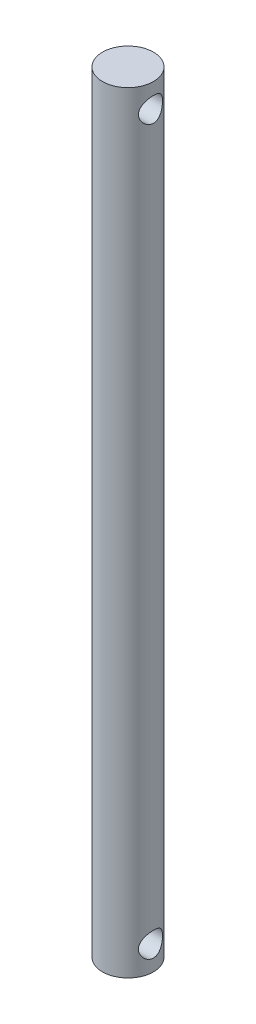
ISO-10303-21;
HEADER;
FILE_DESCRIPTION(('STEP AP214'),'2;1');
FILE_NAME('part.step','',(''),(''),'','','');
FILE_SCHEMA(('AUTOMOTIVE_DESIGN { 1 0 10303 214 1 1 1 1 }'));
ENDSEC;
DATA;
#1=APPLICATION_CONTEXT('core data for automotive mechanical design processes');
#2=APPLICATION_PROTOCOL_DEFINITION('international standard','automotive_design',2000,#1);
#3=PRODUCT_CONTEXT('',#1,'mechanical');
#4=PRODUCT('Part','Part','',(#3));
#5=PRODUCT_RELATED_PRODUCT_CATEGORY('part','',(#4));
#6=PRODUCT_DEFINITION_FORMATION('','',#4);
#7=PRODUCT_DEFINITION_CONTEXT('part definition',#1,'design');
#8=PRODUCT_DEFINITION('design','',#6,#7);
#9=PRODUCT_DEFINITION_SHAPE('','',#8);
#10=(LENGTH_UNIT() NAMED_UNIT(*) SI_UNIT(.MILLI.,.METRE.));
#11=(NAMED_UNIT(*) PLANE_ANGLE_UNIT() SI_UNIT($,.RADIAN.));
#12=(NAMED_UNIT(*) SI_UNIT($,.STERADIAN.) SOLID_ANGLE_UNIT());
#13=UNCERTAINTY_MEASURE_WITH_UNIT(LENGTH_MEASURE(1.E-05),#10,'distance_accuracy_value','');
#14=(GEOMETRIC_REPRESENTATION_CONTEXT(3) GLOBAL_UNCERTAINTY_ASSIGNED_CONTEXT((#13)) GLOBAL_UNIT_ASSIGNED_CONTEXT((#10,
#11,#12)) REPRESENTATION_CONTEXT('',''));
#15=CARTESIAN_POINT('',(0.,0.,0.));
#16=DIRECTION('',(0.,0.,1.));
#17=DIRECTION('',(1.,0.,0.));
#18=AXIS2_PLACEMENT_3D('',#15,#16,#17);
#19=CARTESIAN_POINT('',(0.,48.,0.));
#20=DIRECTION('',(0.,-1.,0.));
#21=DIRECTION('',(0.,0.,-1.));
#22=AXIS2_PLACEMENT_3D('',#19,#20,#21);
#23=CYLINDRICAL_SURFACE('',#22,3.175);
#24=CARTESIAN_POINT('',(-3.175,43.5,0.));
#25=CARTESIAN_POINT('',(-3.17499621985295,43.5000044738965,-0.0793696056331879));
#26=CARTESIAN_POINT('',(-3.17199120370814,43.5063366465158,-0.158848966213319));
#27=CARTESIAN_POINT('',(-3.16026762742416,43.5314003871425,-0.3154907966577));
#28=CARTESIAN_POINT('',(-3.15153670753249,43.5501587788742,-0.392647876041672));
#29=CARTESIAN_POINT('',(-3.12928185140191,43.5991953661397,-0.54213461401645));
#30=CARTESIAN_POINT('',(-3.11577583396693,43.629430525312,-0.614481134826975));
#31=CARTESIAN_POINT('',(-3.08523557557938,43.7003555316825,-0.752982757479882));
#32=CARTESIAN_POINT('',(-3.06820187122341,43.7410437890858,-0.819138798737006));
#33=CARTESIAN_POINT('',(-3.03109215002452,43.8343133724531,-0.947531977551394));
#34=CARTESIAN_POINT('',(-3.01089949607389,43.8874310823474,-1.00934531536299));
#35=CARTESIAN_POINT('',(-2.97016877751052,44.0029059845819,-1.12356872804672));
#36=CARTESIAN_POINT('',(-2.94963048974006,44.0652693664885,-1.17597245123061));
#37=CARTESIAN_POINT('',(-2.90895734211161,44.2025156354503,-1.27340721108708));
#38=CARTESIAN_POINT('',(-2.88894252906622,44.2779584568552,-1.31770529611402));
#39=CARTESIAN_POINT('',(-2.85350194913633,44.4362854939492,-1.39279860497067));
#40=CARTESIAN_POINT('',(-2.83807319122875,44.5191648134291,-1.4236026358555));
#41=CARTESIAN_POINT('',(-2.81484981523147,44.6851826700235,-1.46896762087975));
#42=CARTESIAN_POINT('',(-2.80667245171199,44.7680408954135,-1.48434942407678));
#43=CARTESIAN_POINT('',(-2.79782290647243,44.9355333003305,-1.50096994970779));
#44=CARTESIAN_POINT('',(-2.79714463118969,45.0201659819401,-1.5022201551264));
#45=CARTESIAN_POINT('',(-2.80305593263809,45.1793753085977,-1.49114871052963));
#46=CARTESIAN_POINT('',(-2.80889771224103,45.2540831594443,-1.48022366031689));
#47=CARTESIAN_POINT('',(-2.82589657910714,45.4004446808648,-1.44750469243097));
#48=CARTESIAN_POINT('',(-2.83705508237193,45.4720975322594,-1.42570787921159));
#49=CARTESIAN_POINT('',(-2.86368711079333,45.6123214572522,-1.37144042107045));
#50=CARTESIAN_POINT('',(-2.87925460442575,45.6807826932706,-1.33873421633753));
#51=CARTESIAN_POINT('',(-2.91294481240157,45.8115557706918,-1.26375034917988));
#52=CARTESIAN_POINT('',(-2.93106865023239,45.8738648877214,-1.22146847336964));
#53=CARTESIAN_POINT('',(-2.97027967308475,45.9978860178986,-1.12301829304094));
#54=CARTESIAN_POINT('',(-2.99147184174414,46.0587553417355,-1.06582685913966));
#55=CARTESIAN_POINT('',(-3.03276969244738,46.1703669210121,-0.941911654521736));
#56=CARTESIAN_POINT('',(-3.05287495516681,46.2211052880128,-0.875184240523146));
#57=CARTESIAN_POINT('',(-3.09065813188422,46.3127655304946,-0.730900451942524));
#58=CARTESIAN_POINT('',(-3.10821737934191,46.3532501250906,-0.653032764749386));
#59=CARTESIAN_POINT('',(-3.13795896561378,46.4202348527413,-0.49054980640996));
#60=CARTESIAN_POINT('',(-3.15014513198242,46.4467449432795,-0.405939389394615));
#61=CARTESIAN_POINT('',(-3.16698849385516,46.4830467216995,-0.239325331183664));
#62=CARTESIAN_POINT('',(-3.17215069636453,46.4939630222513,-0.15761808537237));
#63=CARTESIAN_POINT('',(-3.17605374308904,46.5022345017253,0.00662006237334106));
#64=CARTESIAN_POINT('',(-3.17479716715133,46.499595128966,0.0891506200914325));
#65=CARTESIAN_POINT('',(-3.16631250425399,46.4815410497741,0.246790904756254));
#66=CARTESIAN_POINT('',(-3.15949303898597,46.4670003178788,0.322025617263288));
#67=CARTESIAN_POINT('',(-3.14106249856194,46.4268725337062,0.468859911387633));
#68=CARTESIAN_POINT('',(-3.12945086824544,46.4012842015756,0.540459070755479));
#69=CARTESIAN_POINT('',(-3.10206629000487,46.3390272240195,0.680482664613306));
#70=CARTESIAN_POINT('',(-3.08617757605381,46.3020454041442,0.748744433690324));
#71=CARTESIAN_POINT('',(-3.0518284264566,46.2183945744512,0.878333413113472));
#72=CARTESIAN_POINT('',(-3.0333668635778,46.1717213141435,0.939657562453442));
#73=CARTESIAN_POINT('',(-2.99374847615918,46.0651598356938,1.05944471500475));
#74=CARTESIAN_POINT('',(-2.97249840501299,46.0044619699174,1.11715821701519));
#75=CARTESIAN_POINT('',(-2.9310107026401,45.8740799566267,1.22187582163969));
#76=CARTESIAN_POINT('',(-2.91077359415055,45.8043912344258,1.26887443843489));
#77=CARTESIAN_POINT('',(-2.8729842223829,45.6548413943002,1.3523177360002));
#78=CARTESIAN_POINT('',(-2.85555063245794,45.5747097231494,1.3883357483136));
#79=CARTESIAN_POINT('',(-2.82679504093384,45.4084242639191,1.44599796651068));
#80=CARTESIAN_POINT('',(-2.81546607860886,45.3222774617187,1.46765854978947));
#81=CARTESIAN_POINT('',(-2.80148148307169,45.154863402907,1.49416555358527));
#82=CARTESIAN_POINT('',(-2.79812792823293,45.0738695282687,1.50036748851185));
#83=CARTESIAN_POINT('',(-2.79854075870541,44.9119743281721,1.4995991124721));
#84=CARTESIAN_POINT('',(-2.80230499174775,44.8310729821365,1.4926327833113));
#85=CARTESIAN_POINT('',(-2.81582109373829,44.6781381418332,1.46695547456854));
#86=CARTESIAN_POINT('',(-2.82509293077013,44.605899684291,1.44918362899975));
#87=CARTESIAN_POINT('',(-2.84807658169596,44.4654710458926,1.40347262111118));
#88=CARTESIAN_POINT('',(-2.86178973121637,44.3972820901435,1.37553039996267));
#89=CARTESIAN_POINT('',(-2.89323433363553,44.2618894481708,1.30816165903836));
#90=CARTESIAN_POINT('',(-2.9111726221189,44.1950540304397,1.2680940753401));
#91=CARTESIAN_POINT('',(-2.94862781691945,44.0686392018157,1.1783806973407));
#92=CARTESIAN_POINT('',(-2.96814547541437,44.0090632825204,1.12873032344155));
#93=CARTESIAN_POINT('',(-3.00898948839188,43.8924439215314,1.01518945377103));
#94=CARTESIAN_POINT('',(-3.03029315236505,43.8363061865829,0.950355540908536));
#95=CARTESIAN_POINT('',(-3.07039060771353,43.7355582457251,0.811506446201235));
#96=CARTESIAN_POINT('',(-3.08918318329392,43.6909536141019,0.737486850130159));
#97=CARTESIAN_POINT('',(-3.12214803509559,43.6149536802251,0.582310323359671));
#98=CARTESIAN_POINT('',(-3.13633626105316,43.5835126661608,0.501179295246578));
#99=CARTESIAN_POINT('',(-3.15849550789229,43.5350975759745,0.334041202489535));
#100=CARTESIAN_POINT('',(-3.16648489362115,43.5180807524037,0.248049357078901));
#101=CARTESIAN_POINT('',(-3.17226666174443,43.5057935666016,0.134449327489636));
#102=CARTESIAN_POINT('',(-3.17328951708221,43.5036234480032,0.10761975081623));
#103=CARTESIAN_POINT('',(-3.17465683516496,43.5007258896191,0.0538643319459688));
#104=CARTESIAN_POINT('',(-3.17500128300303,43.4999984815345,0.0269384876468133));
#105=CARTESIAN_POINT('',(-3.175,43.5,0.));
#106=B_SPLINE_CURVE_WITH_KNOTS('',3,(#24,#25,#26,#27,#28,#29,#30,#31,#32,#33,#34,#35,#36,#37,
#38,#39,#40,#41,#42,#43,#44,#45,#46,#47,#48,#49,#50,#51,#52,#53,#54,#55,#56,#57,#58,#59,#60,#61,
#62,#63,#64,#65,#66,#67,#68,#69,#70,#71,#72,#73,#74,#75,#76,#77,#78,#79,#80,#81,#82,#83,#84,#85,
#86,#87,#88,#89,#90,#91,#92,#93,#94,#95,#96,#97,#98,#99,#100,#101,#102,#103,#104,#105),
.UNSPECIFIED.,.T.,.F.,(4,2,2,2,2,2,2,2,2,2,2,2,2,2,2,2,2,2,2,2,2,2,2,2,2,2,2,2,2,2,2,2,2,2,2,2,
2,2,2,2,4),(0.,0.237998863435127,0.476513162034362,0.714141760487184,0.951734239756927,
1.202566267352,1.4535669805023,1.72144991719773,1.98915775546695,2.24170968929963,
2.4940563909499,2.72018464462582,2.94637315667184,3.17780125644152,3.40933138528569,
3.66670059385932,3.92416839616744,4.19124985366183,4.45814074508092,4.70459764976704,
4.9509555058397,5.18069145066332,5.41045401730286,5.6472008989094,5.88405183355053,
6.14213867221335,6.40035735120202,6.66760822573515,6.93455372246491,7.17710763594645,
7.41958821796887,7.64352093670396,7.86752106087491,8.10644389425159,8.34548119240928,
8.60934561245707,8.8733373285024,9.13640455025374,9.39868939422998,9.47946576344205,
9.56024390756227),.UNSPECIFIED.);
#107=CARTESIAN_POINT('',(-3.175,43.5,0.));
#108=VERTEX_POINT('',#107);
#109=EDGE_CURVE('E58',#108,#108,#106,.T.);
#110=ORIENTED_EDGE('',*,*,#109,.T.);
#111=EDGE_LOOP('',(#110));
#112=FACE_BOUND('',#111,.T.);
#113=CARTESIAN_POINT('',(2.7983253920872,45.,-1.5));
#114=CARTESIAN_POINT('',(2.79833097649977,44.921189252399,-1.49999523547047));
#115=CARTESIAN_POINT('',(2.80170427159323,44.8422643877943,-1.49374832449328));
#116=CARTESIAN_POINT('',(2.81472644561665,44.6867853324853,-1.4690554061353));
#117=CARTESIAN_POINT('',(2.82438992585351,44.6102370928371,-1.45058101361493));
#118=CARTESIAN_POINT('',(2.84863009396432,44.4620473262433,-1.40237253355636));
#119=CARTESIAN_POINT('',(2.86318279906116,44.3903838635682,-1.37269332197988));
#120=CARTESIAN_POINT('',(2.89552502377023,44.2530706071524,-1.30308399064543));
#121=CARTESIAN_POINT('',(2.91331440566267,44.1874205577211,-1.26315430701281));
#122=CARTESIAN_POINT('',(2.95172227722859,44.0586767547416,-1.17074308715241));
#123=CARTESIAN_POINT('',(2.97245254188493,43.9961221115093,-1.11755658650796));
#124=CARTESIAN_POINT('',(3.01349951044786,43.8804085631506,-1.00161259672222));
#125=CARTESIAN_POINT('',(3.03381602228766,43.8272539373996,-0.938850772491952));
#126=CARTESIAN_POINT('',(3.07317288716969,43.7288106204522,-0.801034900704522));
#127=CARTESIAN_POINT('',(3.09206866660246,43.6841654987483,-0.725476017233371));
#128=CARTESIAN_POINT('',(3.12503381595021,43.6084624779382,-0.56686168661916));
#129=CARTESIAN_POINT('',(3.13910591174128,43.5773969022547,-0.483810507023554));
#130=CARTESIAN_POINT('',(3.16003750546179,43.5318056801438,-0.318263833167136));
#131=CARTESIAN_POINT('',(3.16730464125021,43.5163401993996,-0.236079837596822));
#132=CARTESIAN_POINT('',(3.17531500926786,43.4993133015371,-0.0699854874354073));
#133=CARTESIAN_POINT('',(3.17606171435844,43.4977444828797,0.0139239243031299));
#134=CARTESIAN_POINT('',(3.1711569999128,43.5081468926195,0.174104046955922));
#135=CARTESIAN_POINT('',(3.16599910390162,43.5190736315719,0.25046092630755));
#136=CARTESIAN_POINT('',(3.15058713309443,43.5523154880051,0.400106757592314));
#137=CARTESIAN_POINT('',(3.14033267949386,43.574631452,0.473395481043944));
#138=CARTESIAN_POINT('',(3.11549383971164,43.6302181918803,0.61616215999247));
#139=CARTESIAN_POINT('',(3.10084769916082,43.663645999974,0.685567785451937));
#140=CARTESIAN_POINT('',(3.06858481389696,43.740319036478,0.817962218284118));
#141=CARTESIAN_POINT('',(3.05096698193041,43.7835678601183,0.880948663490015));
#142=CARTESIAN_POINT('',(3.01265189942244,43.8829822343299,1.00453666893054));
#143=CARTESIAN_POINT('',(2.9918200943109,43.9399426319685,1.06445784147851));
#144=CARTESIAN_POINT('',(2.95046283361779,44.0630029403556,1.1742412493389));
#145=CARTESIAN_POINT('',(2.92993757775204,44.1291085440488,1.2240971710571));
#146=CARTESIAN_POINT('',(2.89039711066438,44.2728278618489,1.31484174230845));
#147=CARTESIAN_POINT('',(2.87151577260243,44.3508610580037,1.3551298636546));
#148=CARTESIAN_POINT('',(2.83914834140001,44.513716256469,1.42170562946272));
#149=CARTESIAN_POINT('',(2.82565717160027,44.5985317801244,1.44800645544408));
#150=CARTESIAN_POINT('',(2.8069797461398,44.7657462952624,1.48387059914899));
#151=CARTESIAN_POINT('',(2.80124227464673,44.8478424419302,1.4945499135996));
#152=CARTESIAN_POINT('',(2.79714234532469,45.0128364544629,1.50221328025957));
#153=CARTESIAN_POINT('',(2.79877582206014,45.0957338532269,1.49920488189903));
#154=CARTESIAN_POINT('',(2.80865284380239,45.2518411011807,1.4806017347564));
#155=CARTESIAN_POINT('',(2.81627144126264,45.3252381335397,1.46619608896934));
#156=CARTESIAN_POINT('',(2.83637948512089,45.4684636330514,1.42690562153975));
#157=CARTESIAN_POINT('',(2.8488703210638,45.5382910757385,1.40201781025962));
#158=CARTESIAN_POINT('',(2.87800314814948,45.676035807525,1.3412324594274));
#159=CARTESIAN_POINT('',(2.89481019393091,45.7437159941401,1.30487958898416));
#160=CARTESIAN_POINT('',(2.93050507850425,45.8723898286008,1.22260967416881));
#161=CARTESIAN_POINT('',(2.94939395301752,45.933380117806,1.17668785898318));
#162=CARTESIAN_POINT('',(2.98962533435876,46.0539512242928,1.07066250220429));
#163=CARTESIAN_POINT('',(3.0110091844446,46.1126390091907,1.00955462247668));
#164=CARTESIAN_POINT('',(3.05197816465585,46.2191662131219,0.877952835832726));
#165=CARTESIAN_POINT('',(3.07156288076261,46.2670031388463,0.807456777596013));
#166=CARTESIAN_POINT('',(3.10717258491727,46.351063404327,0.657374049291598));
#167=CARTESIAN_POINT('',(3.12313361565429,46.3870824417787,0.577656753882329));
#168=CARTESIAN_POINT('',(3.14922093597641,46.4448659350236,0.412327293299585));
#169=CARTESIAN_POINT('',(3.15935178938716,46.4666415423121,0.326719797872879));
#170=CARTESIAN_POINT('',(3.17197971044583,46.4936388943546,0.159896332874223));
#171=CARTESIAN_POINT('',(3.17505233840113,46.5001101363264,0.078925398284079));
#172=CARTESIAN_POINT('',(3.17494636529876,46.4998871196568,-0.0829833461657169));
#173=CARTESIAN_POINT('',(3.17176950877122,46.4931965351109,-0.163921158963004));
#174=CARTESIAN_POINT('',(3.15985410378094,46.4677084802309,-0.318841842835547));
#175=CARTESIAN_POINT('',(3.15142868675494,46.4495919749199,-0.392963167600613));
#176=CARTESIAN_POINT('',(3.13010132928976,46.4026210854748,-0.53702643402249));
#177=CARTESIAN_POINT('',(3.1171986764347,46.3737649924088,-0.606967708474029));
#178=CARTESIAN_POINT('',(3.08738510301285,46.3047349018929,-0.744198443618439));
#179=CARTESIAN_POINT('',(3.0703197298679,46.2641093939082,-0.811226286131094));
#180=CARTESIAN_POINT('',(3.03405477724481,46.1732843209197,-0.937805412907553));
#181=CARTESIAN_POINT('',(3.01485423033003,46.1230804085548,-0.997353281796322));
#182=CARTESIAN_POINT('',(2.97425749382228,46.0092844677808,-1.11287613406119));
#183=CARTESIAN_POINT('',(2.9528185885393,45.9448963731736,-1.16805442942683));
#184=CARTESIAN_POINT('',(2.91171333700677,45.8073121457485,-1.26705651381278));
#185=CARTESIAN_POINT('',(2.89204830000693,45.7341095987445,-1.31087196019013));
#186=CARTESIAN_POINT('',(2.85663554941127,45.5792324222108,-1.3863737982034));
#187=CARTESIAN_POINT('',(2.84095675906997,45.4974393525252,-1.41785130272303));
#188=CARTESIAN_POINT('',(2.81635628214136,45.3288119983292,-1.4661232120466));
#189=CARTESIAN_POINT('',(2.80741192483264,45.2419956966721,-1.48296690968124));
#190=CARTESIAN_POINT('',(2.80116429672363,45.128694633248,-1.49469268672873));
#191=CARTESIAN_POINT('',(2.80010260103933,45.1030118077476,-1.49668048940514));
#192=CARTESIAN_POINT('',(2.79868221732461,45.0515567295082,-1.49933495903092));
#193=CARTESIAN_POINT('',(2.79832356503778,45.0257844722891,-1.50000155880871));
#194=CARTESIAN_POINT('',(2.7983253920872,45.,-1.5));
#195=B_SPLINE_CURVE_WITH_KNOTS('',3,(#113,#114,#115,#116,#117,#118,#119,#120,#121,#122,#123,
#124,#125,#126,#127,#128,#129,#130,#131,#132,#133,#134,#135,#136,#137,#138,#139,#140,#141,#142,
#143,#144,#145,#146,#147,#148,#149,#150,#151,#152,#153,#154,#155,#156,#157,#158,#159,#160,#161,
#162,#163,#164,#165,#166,#167,#168,#169,#170,#171,#172,#173,#174,#175,#176,#177,#178,#179,#180,
#181,#182,#183,#184,#185,#186,#187,#188,#189,#190,#191,#192,#193,#194),.UNSPECIFIED.,.T.,.F.,(4,
2,2,2,2,2,2,2,2,2,2,2,2,2,2,2,2,2,2,2,2,2,2,2,2,2,2,2,2,2,2,2,2,2,2,2,2,2,2,2,4),(0.,
0.236323871838541,0.473198284289301,0.7089273373807,0.944646362603907,1.19762429635864,
1.45071710395354,1.71864285343498,1.98641694681215,2.23687152724757,2.48719270436037,
2.71802817018661,2.94888079555675,3.18314531005561,3.41749572162706,3.67216706074964,
3.92699765369087,4.19506898546715,4.46288723920479,4.71043828617549,4.95785281342715,
5.18239796950746,5.4070072119373,5.64198832122139,5.87708686716683,6.13804637958085,
6.39906579463174,6.66438519401193,6.92949661955738,7.17207877892644,7.41459323161728,
7.64386670961211,7.87317668624822,8.11282240294708,8.35257714778319,8.61378861881716,
8.87519133270405,9.14084608292566,9.40560248746477,9.4829165180197,9.56023447921351),.UNSPECIFIED.);
#196=CARTESIAN_POINT('',(2.7983253920872,45.,-1.5));
#197=VERTEX_POINT('',#196);
#198=EDGE_CURVE('E64',#197,#197,#195,.T.);
#199=ORIENTED_EDGE('',*,*,#198,.T.);
#200=EDGE_LOOP('',(#199));
#201=FACE_BOUND('',#200,.T.);
#202=CARTESIAN_POINT('',(0.,48.,0.));
#203=DIRECTION('',(0.,1.,0.));
#204=DIRECTION('',(0.,0.,1.));
#205=AXIS2_PLACEMENT_3D('',#202,#203,#204);
#206=CIRCLE('',#205,3.175);
#207=CARTESIAN_POINT('',(0.,48.,3.175));
#208=VERTEX_POINT('',#207);
#209=EDGE_CURVE('E92',#208,#208,#206,.T.);
#210=ORIENTED_EDGE('',*,*,#209,.F.);
#211=EDGE_LOOP('',(#210));
#212=FACE_BOUND('',#211,.T.);
#213=CARTESIAN_POINT('',(0.,-48.,0.));
#214=DIRECTION('',(0.,1.,0.));
#215=DIRECTION('',(0.,0.,1.));
#216=AXIS2_PLACEMENT_3D('',#213,#214,#215);
#217=CIRCLE('',#216,3.175);
#218=CARTESIAN_POINT('',(0.,-48.,3.175));
#219=VERTEX_POINT('',#218);
#220=EDGE_CURVE('E93',#219,#219,#217,.T.);
#221=ORIENTED_EDGE('',*,*,#220,.T.);
#222=EDGE_LOOP('',(#221));
#223=FACE_BOUND('',#222,.T.);
#224=CARTESIAN_POINT('',(2.7983253920872,-45.,-1.5));
#225=CARTESIAN_POINT('',(2.79833097649977,-44.921189252399,-1.49999523547047));
#226=CARTESIAN_POINT('',(2.80170427159323,-44.8422643877943,-1.49374832449328));
#227=CARTESIAN_POINT('',(2.81472644561665,-44.6867853324853,-1.4690554061353));
#228=CARTESIAN_POINT('',(2.82438992585351,-44.6102370928371,-1.45058101361493));
#229=CARTESIAN_POINT('',(2.84863009396432,-44.4620473262433,-1.40237253355636));
#230=CARTESIAN_POINT('',(2.86318279906116,-44.3903838635682,-1.37269332197988));
#231=CARTESIAN_POINT('',(2.89552502377023,-44.2530706071524,-1.30308399064543));
#232=CARTESIAN_POINT('',(2.91331440566267,-44.1874205577211,-1.26315430701281));
#233=CARTESIAN_POINT('',(2.95172227722859,-44.0586767547416,-1.17074308715241));
#234=CARTESIAN_POINT('',(2.97245254188493,-43.9961221115093,-1.11755658650796));
#235=CARTESIAN_POINT('',(3.01349951044786,-43.8804085631506,-1.00161259672222));
#236=CARTESIAN_POINT('',(3.03381602228766,-43.8272539373996,-0.938850772491952));
#237=CARTESIAN_POINT('',(3.07317288716969,-43.7288106204522,-0.801034900704522));
#238=CARTESIAN_POINT('',(3.09206866660246,-43.6841654987483,-0.725476017233371));
#239=CARTESIAN_POINT('',(3.12503381595021,-43.6084624779382,-0.56686168661916));
#240=CARTESIAN_POINT('',(3.13910591174128,-43.5773969022547,-0.483810507023554));
#241=CARTESIAN_POINT('',(3.16003750546179,-43.5318056801438,-0.318263833167136));
#242=CARTESIAN_POINT('',(3.16730464125021,-43.5163401993996,-0.236079837596822));
#243=CARTESIAN_POINT('',(3.17531500926786,-43.4993133015371,-0.0699854874354073));
#244=CARTESIAN_POINT('',(3.17606171435844,-43.4977444828797,0.0139239243031299));
#245=CARTESIAN_POINT('',(3.1711569999128,-43.5081468926195,0.174104046955922));
#246=CARTESIAN_POINT('',(3.16599910390162,-43.5190736315719,0.25046092630755));
#247=CARTESIAN_POINT('',(3.15058713309443,-43.5523154880051,0.400106757592314));
#248=CARTESIAN_POINT('',(3.14033267949386,-43.574631452,0.473395481043944));
#249=CARTESIAN_POINT('',(3.11549383971164,-43.6302181918803,0.61616215999247));
#250=CARTESIAN_POINT('',(3.10084769916082,-43.663645999974,0.685567785451937));
#251=CARTESIAN_POINT('',(3.06858481389696,-43.740319036478,0.817962218284118));
#252=CARTESIAN_POINT('',(3.05096698193041,-43.7835678601183,0.880948663490015));
#253=CARTESIAN_POINT('',(3.01265189942244,-43.8829822343299,1.00453666893054));
#254=CARTESIAN_POINT('',(2.9918200943109,-43.9399426319685,1.06445784147851));
#255=CARTESIAN_POINT('',(2.95046283361779,-44.0630029403556,1.1742412493389));
#256=CARTESIAN_POINT('',(2.92993757775204,-44.1291085440488,1.2240971710571));
#257=CARTESIAN_POINT('',(2.89039711066438,-44.2728278618489,1.31484174230845));
#258=CARTESIAN_POINT('',(2.87151577260243,-44.3508610580037,1.3551298636546));
#259=CARTESIAN_POINT('',(2.83914834140001,-44.513716256469,1.42170562946272));
#260=CARTESIAN_POINT('',(2.82565717160027,-44.5985317801244,1.44800645544408));
#261=CARTESIAN_POINT('',(2.8069797461398,-44.7657462952624,1.48387059914899));
#262=CARTESIAN_POINT('',(2.80124227464673,-44.8478424419302,1.4945499135996));
#263=CARTESIAN_POINT('',(2.79714234532469,-45.0128364544629,1.50221328025957));
#264=CARTESIAN_POINT('',(2.79877582206014,-45.0957338532269,1.49920488189903));
#265=CARTESIAN_POINT('',(2.80865284380239,-45.2518411011807,1.4806017347564));
#266=CARTESIAN_POINT('',(2.81627144126264,-45.3252381335397,1.46619608896934));
#267=CARTESIAN_POINT('',(2.83637948512089,-45.4684636330514,1.42690562153975));
#268=CARTESIAN_POINT('',(2.8488703210638,-45.5382910757385,1.40201781025962));
#269=CARTESIAN_POINT('',(2.87800314814948,-45.676035807525,1.3412324594274));
#270=CARTESIAN_POINT('',(2.89481019393091,-45.7437159941401,1.30487958898416));
#271=CARTESIAN_POINT('',(2.93050507850425,-45.8723898286008,1.22260967416881));
#272=CARTESIAN_POINT('',(2.94939395301752,-45.933380117806,1.17668785898318));
#273=CARTESIAN_POINT('',(2.98962533435876,-46.0539512242928,1.07066250220429));
#274=CARTESIAN_POINT('',(3.0110091844446,-46.1126390091907,1.00955462247668));
#275=CARTESIAN_POINT('',(3.05197816465585,-46.2191662131219,0.877952835832726));
#276=CARTESIAN_POINT('',(3.07156288076261,-46.2670031388463,0.807456777596013));
#277=CARTESIAN_POINT('',(3.10717258491727,-46.351063404327,0.657374049291598));
#278=CARTESIAN_POINT('',(3.12313361565429,-46.3870824417787,0.577656753882329));
#279=CARTESIAN_POINT('',(3.14922093597641,-46.4448659350236,0.412327293299585));
#280=CARTESIAN_POINT('',(3.15935178938716,-46.4666415423121,0.326719797872879));
#281=CARTESIAN_POINT('',(3.17197971044583,-46.4936388943546,0.159896332874223));
#282=CARTESIAN_POINT('',(3.17505233840113,-46.5001101363264,0.078925398284079));
#283=CARTESIAN_POINT('',(3.17494636529876,-46.4998871196568,-0.0829833461657169));
#284=CARTESIAN_POINT('',(3.17176950877122,-46.4931965351109,-0.163921158963004));
#285=CARTESIAN_POINT('',(3.15985410378094,-46.4677084802309,-0.318841842835547));
#286=CARTESIAN_POINT('',(3.15142868675494,-46.4495919749199,-0.392963167600613));
#287=CARTESIAN_POINT('',(3.13010132928976,-46.4026210854748,-0.53702643402249));
#288=CARTESIAN_POINT('',(3.1171986764347,-46.3737649924088,-0.606967708474029));
#289=CARTESIAN_POINT('',(3.08738510301285,-46.3047349018929,-0.744198443618439));
#290=CARTESIAN_POINT('',(3.0703197298679,-46.2641093939082,-0.811226286131094));
#291=CARTESIAN_POINT('',(3.03405477724481,-46.1732843209197,-0.937805412907553));
#292=CARTESIAN_POINT('',(3.01485423033003,-46.1230804085548,-0.997353281796322));
#293=CARTESIAN_POINT('',(2.97425749382228,-46.0092844677808,-1.11287613406119));
#294=CARTESIAN_POINT('',(2.9528185885393,-45.9448963731736,-1.16805442942683));
#295=CARTESIAN_POINT('',(2.91171333700677,-45.8073121457485,-1.26705651381278));
#296=CARTESIAN_POINT('',(2.89204830000693,-45.7341095987445,-1.31087196019013));
#297=CARTESIAN_POINT('',(2.85663554941127,-45.5792324222108,-1.3863737982034));
#298=CARTESIAN_POINT('',(2.84095675906997,-45.4974393525252,-1.41785130272303));
#299=CARTESIAN_POINT('',(2.81635628214136,-45.3288119983292,-1.4661232120466));
#300=CARTESIAN_POINT('',(2.80741192483264,-45.2419956966721,-1.48296690968124));
#301=CARTESIAN_POINT('',(2.80116429672363,-45.128694633248,-1.49469268672873));
#302=CARTESIAN_POINT('',(2.80010260103933,-45.1030118077476,-1.49668048940514));
#303=CARTESIAN_POINT('',(2.79868221732461,-45.0515567295082,-1.49933495903092));
#304=CARTESIAN_POINT('',(2.79832356503778,-45.0257844722891,-1.50000155880871));
#305=CARTESIAN_POINT('',(2.7983253920872,-45.,-1.5));
#306=B_SPLINE_CURVE_WITH_KNOTS('',3,(#224,#225,#226,#227,#228,#229,#230,#231,#232,#233,#234,
#235,#236,#237,#238,#239,#240,#241,#242,#243,#244,#245,#246,#247,#248,#249,#250,#251,#252,#253,
#254,#255,#256,#257,#258,#259,#260,#261,#262,#263,#264,#265,#266,#267,#268,#269,#270,#271,#272,
#273,#274,#275,#276,#277,#278,#279,#280,#281,#282,#283,#284,#285,#286,#287,#288,#289,#290,#291,
#292,#293,#294,#295,#296,#297,#298,#299,#300,#301,#302,#303,#304,#305),.UNSPECIFIED.,.T.,.F.,(4,
2,2,2,2,2,2,2,2,2,2,2,2,2,2,2,2,2,2,2,2,2,2,2,2,2,2,2,2,2,2,2,2,2,2,2,2,2,2,2,4),(0.,
0.236323871838541,0.473198284289301,0.7089273373807,0.944646362603907,1.19762429635864,
1.45071710395354,1.71864285343498,1.98641694681215,2.23687152724757,2.48719270436037,
2.71802817018661,2.94888079555675,3.18314531005561,3.41749572162706,3.67216706074964,
3.92699765369087,4.19506898546715,4.46288723920479,4.71043828617549,4.95785281342715,
5.18239796950746,5.4070072119373,5.64198832122139,5.87708686716683,6.13804637958085,
6.39906579463174,6.66438519401193,6.92949661955738,7.17207877892644,7.41459323161728,
7.64386670961211,7.87317668624822,8.11282240294708,8.35257714778319,8.61378861881716,
8.87519133270405,9.14084608292566,9.40560248746477,9.4829165180197,9.56023447921351),.UNSPECIFIED.);
#307=CARTESIAN_POINT('',(2.7983253920872,-45.,-1.5));
#308=VERTEX_POINT('',#307);
#309=EDGE_CURVE('E52',#308,#308,#306,.T.);
#310=ORIENTED_EDGE('',*,*,#309,.F.);
#311=EDGE_LOOP('',(#310));
#312=FACE_BOUND('',#311,.T.);
#313=CARTESIAN_POINT('',(-3.175,-46.5,0.));
#314=CARTESIAN_POINT('',(-3.17499621985295,-46.4999955261035,0.0793696056331879));
#315=CARTESIAN_POINT('',(-3.17199120370814,-46.4936633534842,0.158848966213319));
#316=CARTESIAN_POINT('',(-3.16026762742416,-46.4685996128575,0.3154907966577));
#317=CARTESIAN_POINT('',(-3.15153670753249,-46.4498412211258,0.392647876041672));
#318=CARTESIAN_POINT('',(-3.12928185140191,-46.4008046338603,0.54213461401645));
#319=CARTESIAN_POINT('',(-3.11577583396693,-46.370569474688,0.614481134826975));
#320=CARTESIAN_POINT('',(-3.08523557557938,-46.2996444683175,0.752982757479882));
#321=CARTESIAN_POINT('',(-3.06820187122341,-46.2589562109142,0.819138798737006));
#322=CARTESIAN_POINT('',(-3.03109215002452,-46.1656866275469,0.947531977551395));
#323=CARTESIAN_POINT('',(-3.01089949607389,-46.1125689176526,1.00934531536299));
#324=CARTESIAN_POINT('',(-2.97016877751052,-45.997094015418,1.12356872804672));
#325=CARTESIAN_POINT('',(-2.94963048974006,-45.9347306335115,1.17597245123061));
#326=CARTESIAN_POINT('',(-2.90895734211161,-45.7974843645497,1.27340721108708));
#327=CARTESIAN_POINT('',(-2.88894252906622,-45.7220415431448,1.31770529611402));
#328=CARTESIAN_POINT('',(-2.85350194913633,-45.5637145060508,1.39279860497068));
#329=CARTESIAN_POINT('',(-2.83807319122875,-45.4808351865709,1.4236026358555));
#330=CARTESIAN_POINT('',(-2.81484981523147,-45.3148173299765,1.46896762087975));
#331=CARTESIAN_POINT('',(-2.80667245171199,-45.2319591045865,1.48434942407678));
#332=CARTESIAN_POINT('',(-2.79782290647243,-45.0644666996695,1.50096994970779));
#333=CARTESIAN_POINT('',(-2.79714463118969,-44.9798340180599,1.5022201551264));
#334=CARTESIAN_POINT('',(-2.80305593263809,-44.8206246914023,1.49114871052963));
#335=CARTESIAN_POINT('',(-2.80889771224103,-44.7459168405557,1.48022366031689));
#336=CARTESIAN_POINT('',(-2.82589657910714,-44.5995553191352,1.44750469243097));
#337=CARTESIAN_POINT('',(-2.83705508237193,-44.5279024677406,1.42570787921159));
#338=CARTESIAN_POINT('',(-2.86368711079333,-44.3876785427478,1.37144042107045));
#339=CARTESIAN_POINT('',(-2.87925460442575,-44.3192173067294,1.33873421633753));
#340=CARTESIAN_POINT('',(-2.91294481240157,-44.1884442293082,1.26375034917988));
#341=CARTESIAN_POINT('',(-2.93106865023239,-44.1261351122786,1.22146847336964));
#342=CARTESIAN_POINT('',(-2.97027967308475,-44.0021139821014,1.12301829304094));
#343=CARTESIAN_POINT('',(-2.99147184174414,-43.9412446582645,1.06582685913966));
#344=CARTESIAN_POINT('',(-3.03276969244738,-43.8296330789879,0.941911654521736));
#345=CARTESIAN_POINT('',(-3.05287495516681,-43.7788947119872,0.875184240523146));
#346=CARTESIAN_POINT('',(-3.09065813188422,-43.6872344695054,0.730900451942527));
#347=CARTESIAN_POINT('',(-3.10821737934191,-43.6467498749094,0.653032764749392));
#348=CARTESIAN_POINT('',(-3.13795896561378,-43.5797651472587,0.490549806409967));
#349=CARTESIAN_POINT('',(-3.15014513198241,-43.5532550567205,0.405939389394618));
#350=CARTESIAN_POINT('',(-3.16698849385516,-43.5169532783005,0.239325331183664));
#351=CARTESIAN_POINT('',(-3.17215069636453,-43.5060369777487,0.15761808537237));
#352=CARTESIAN_POINT('',(-3.17605374308904,-43.4977654982747,-0.00662006237334111));
#353=CARTESIAN_POINT('',(-3.17479716715133,-43.500404871034,-0.0891506200914325));
#354=CARTESIAN_POINT('',(-3.16631250425399,-43.5184589502259,-0.246790904756254));
#355=CARTESIAN_POINT('',(-3.15949303898597,-43.5329996821211,-0.322025617263288));
#356=CARTESIAN_POINT('',(-3.14106249856194,-43.5731274662938,-0.468859911387633));
#357=CARTESIAN_POINT('',(-3.12945086824544,-43.5987157984244,-0.540459070755479));
#358=CARTESIAN_POINT('',(-3.10206629000487,-43.6609727759805,-0.680482664613306));
#359=CARTESIAN_POINT('',(-3.08617757605381,-43.6979545958558,-0.748744433690324));
#360=CARTESIAN_POINT('',(-3.0518284264566,-43.7816054255488,-0.878333413113472));
#361=CARTESIAN_POINT('',(-3.0333668635778,-43.8282786858565,-0.939657562453442));
#362=CARTESIAN_POINT('',(-2.99374847615918,-43.9348401643062,-1.05944471500475));
#363=CARTESIAN_POINT('',(-2.97249840501299,-43.9955380300826,-1.11715821701519));
#364=CARTESIAN_POINT('',(-2.9310107026401,-44.1259200433733,-1.22187582163969));
#365=CARTESIAN_POINT('',(-2.91077359415055,-44.1956087655742,-1.26887443843489));
#366=CARTESIAN_POINT('',(-2.8729842223829,-44.3451586056998,-1.3523177360002));
#367=CARTESIAN_POINT('',(-2.85555063245793,-44.4252902768506,-1.3883357483136));
#368=CARTESIAN_POINT('',(-2.82679504093384,-44.5915757360809,-1.44599796651068));
#369=CARTESIAN_POINT('',(-2.81546607860886,-44.6777225382813,-1.46765854978947));
#370=CARTESIAN_POINT('',(-2.80148148307169,-44.845136597093,-1.49416555358527));
#371=CARTESIAN_POINT('',(-2.79812792823293,-44.9261304717313,-1.50036748851185));
#372=CARTESIAN_POINT('',(-2.79854075870541,-45.0880256718279,-1.4995991124721));
#373=CARTESIAN_POINT('',(-2.80230499174775,-45.1689270178635,-1.4926327833113));
#374=CARTESIAN_POINT('',(-2.81582109373829,-45.3218618581667,-1.46695547456854));
#375=CARTESIAN_POINT('',(-2.82509293077013,-45.394100315709,-1.44918362899975));
#376=CARTESIAN_POINT('',(-2.84807658169596,-45.5345289541074,-1.40347262111118));
#377=CARTESIAN_POINT('',(-2.86178973121637,-45.6027179098565,-1.37553039996267));
#378=CARTESIAN_POINT('',(-2.89323433363553,-45.7381105518292,-1.30816165903836));
#379=CARTESIAN_POINT('',(-2.9111726221189,-45.8049459695603,-1.26809407534009));
#380=CARTESIAN_POINT('',(-2.94862781691945,-45.9313607981843,-1.17838069734069));
#381=CARTESIAN_POINT('',(-2.96814547541437,-45.9909367174796,-1.12873032344155));
#382=CARTESIAN_POINT('',(-3.00898948839188,-46.1075560784686,-1.01518945377103));
#383=CARTESIAN_POINT('',(-3.03029315236505,-46.1636938134171,-0.950355540908536));
#384=CARTESIAN_POINT('',(-3.07039060771353,-46.2644417542749,-0.811506446201235));
#385=CARTESIAN_POINT('',(-3.08918318329392,-46.3090463858981,-0.737486850130159));
#386=CARTESIAN_POINT('',(-3.12214803509559,-46.3850463197749,-0.582310323359671));
#387=CARTESIAN_POINT('',(-3.13633626105316,-46.4164873338392,-0.501179295246578));
#388=CARTESIAN_POINT('',(-3.15849550789229,-46.4649024240255,-0.334041202489535));
#389=CARTESIAN_POINT('',(-3.16648489362115,-46.4819192475962,-0.248049357078901));
#390=CARTESIAN_POINT('',(-3.17226666174443,-46.4942064333984,-0.134449327489636));
#391=CARTESIAN_POINT('',(-3.17328951708221,-46.4963765519968,-0.10761975081623));
#392=CARTESIAN_POINT('',(-3.17465683516496,-46.4992741103809,-0.0538643319459688));
#393=CARTESIAN_POINT('',(-3.17500128300303,-46.5000015184655,-0.0269384876468133));
#394=CARTESIAN_POINT('',(-3.175,-46.5,0.));
#395=B_SPLINE_CURVE_WITH_KNOTS('',3,(#313,#314,#315,#316,#317,#318,#319,#320,#321,#322,#323,
#324,#325,#326,#327,#328,#329,#330,#331,#332,#333,#334,#335,#336,#337,#338,#339,#340,#341,#342,
#343,#344,#345,#346,#347,#348,#349,#350,#351,#352,#353,#354,#355,#356,#357,#358,#359,#360,#361,
#362,#363,#364,#365,#366,#367,#368,#369,#370,#371,#372,#373,#374,#375,#376,#377,#378,#379,#380,
#381,#382,#383,#384,#385,#386,#387,#388,#389,#390,#391,#392,#393,#394),.UNSPECIFIED.,.T.,.F.,(4,
2,2,2,2,2,2,2,2,2,2,2,2,2,2,2,2,2,2,2,2,2,2,2,2,2,2,2,2,2,2,2,2,2,2,2,2,2,2,2,4),(0.,
0.237998863435127,0.476513162034362,0.714141760487184,0.951734239756927,1.202566267352,
1.4535669805023,1.72144991719773,1.98915775546695,2.24170968929963,2.4940563909499,
2.72018464462582,2.94637315667184,3.17780125644152,3.40933138528569,3.66670059385932,
3.92416839616744,4.19124985366182,4.45814074508092,4.70459764976704,4.9509555058397,
5.18069145066332,5.41045401730286,5.6472008989094,5.88405183355053,6.14213867221335,
6.40035735120202,6.66760822573517,6.93455372246491,7.17710763594645,7.41958821796887,
7.64352093670396,7.86752106087491,8.10644389425159,8.34548119240928,8.60934561245707,
8.8733373285024,9.13640455025374,9.39868939422998,9.47946576344205,9.56024390756227),.UNSPECIFIED.);
#396=CARTESIAN_POINT('',(-3.175,-46.5,0.));
#397=VERTEX_POINT('',#396);
#398=EDGE_CURVE('E10',#397,#397,#395,.T.);
#399=ORIENTED_EDGE('',*,*,#398,.F.);
#400=EDGE_LOOP('',(#399));
#401=FACE_BOUND('',#400,.T.);
#402=ADVANCED_FACE('F40',(#112,#201,#212,#223,#312,#401),#23,.T.);
#403=CARTESIAN_POINT('',(0.,48.,0.));
#404=DIRECTION('',(0.,1.,0.));
#405=DIRECTION('',(0.,0.,1.));
#406=AXIS2_PLACEMENT_3D('',#403,#404,#405);
#407=PLANE('',#406);
#408=ORIENTED_EDGE('',*,*,#209,.T.);
#409=EDGE_LOOP('',(#408));
#410=FACE_BOUND('',#409,.T.);
#411=ADVANCED_FACE('F84',(#410),#407,.T.);
#412=CARTESIAN_POINT('',(0.,-48.,0.));
#413=DIRECTION('',(0.,1.,0.));
#414=DIRECTION('',(0.,0.,1.));
#415=AXIS2_PLACEMENT_3D('',#412,#413,#414);
#416=PLANE('',#415);
#417=ORIENTED_EDGE('',*,*,#220,.F.);
#418=EDGE_LOOP('',(#417));
#419=FACE_BOUND('',#418,.T.);
#420=ADVANCED_FACE('F82',(#419),#416,.F.);
#421=CARTESIAN_POINT('',(-3.175,45.,0.));
#422=DIRECTION('',(1.,0.,0.));
#423=DIRECTION('',(0.,0.,-1.));
#424=AXIS2_PLACEMENT_3D('',#421,#422,#423);
#425=CYLINDRICAL_SURFACE('',#424,1.5);
#426=ORIENTED_EDGE('',*,*,#198,.F.);
#427=EDGE_LOOP('',(#426));
#428=FACE_BOUND('',#427,.T.);
#429=ORIENTED_EDGE('',*,*,#109,.F.);
#430=EDGE_LOOP('',(#429));
#431=FACE_BOUND('',#430,.T.);
#432=ADVANCED_FACE('F77',(#428,#431),#425,.F.);
#433=CARTESIAN_POINT('',(-3.175,-45.,0.));
#434=DIRECTION('',(1.,0.,0.));
#435=DIRECTION('',(0.,0.,-1.));
#436=AXIS2_PLACEMENT_3D('',#433,#434,#435);
#437=CYLINDRICAL_SURFACE('',#436,1.5);
#438=ORIENTED_EDGE('',*,*,#309,.T.);
#439=EDGE_LOOP('',(#438));
#440=FACE_BOUND('',#439,.T.);
#441=ORIENTED_EDGE('',*,*,#398,.T.);
#442=EDGE_LOOP('',(#441));
#443=FACE_BOUND('',#442,.T.);
#444=ADVANCED_FACE('F74',(#440,#443),#437,.F.);
#445=CLOSED_SHELL('',(#402,#411,#420,#432,#444));
#446=MANIFOLD_SOLID_BREP('B2',#445);
#447=ADVANCED_BREP_SHAPE_REPRESENTATION('',(#18,#446),#14);
#448=SHAPE_DEFINITION_REPRESENTATION(#9,#447);
ENDSEC;
END-ISO-10303-21;
